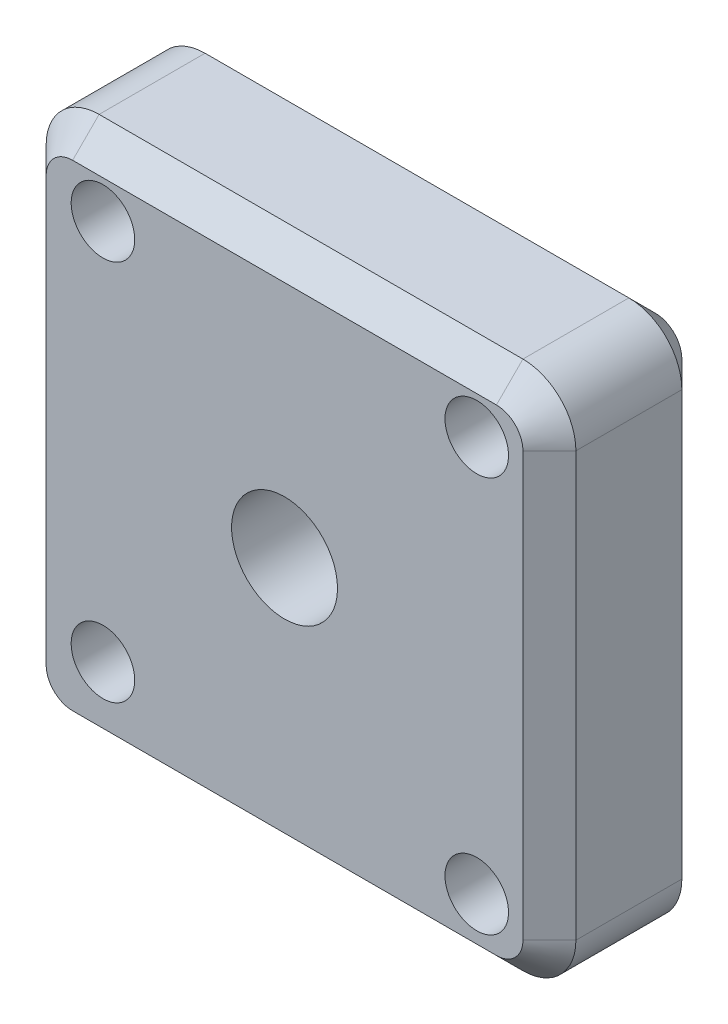
ISO-10303-21;
HEADER;
FILE_DESCRIPTION(('STEP AP214'),'2;1');
FILE_NAME('part.step','',(''),(''),'','','');
FILE_SCHEMA(('AUTOMOTIVE_DESIGN { 1 0 10303 214 1 1 1 1 }'));
ENDSEC;
DATA;
#1=APPLICATION_CONTEXT('core data for automotive mechanical design processes');
#2=APPLICATION_PROTOCOL_DEFINITION('international standard','automotive_design',2000,#1);
#3=PRODUCT_CONTEXT('',#1,'mechanical');
#4=PRODUCT('Part','Part','',(#3));
#5=PRODUCT_RELATED_PRODUCT_CATEGORY('part','',(#4));
#6=PRODUCT_DEFINITION_FORMATION('','',#4);
#7=PRODUCT_DEFINITION_CONTEXT('part definition',#1,'design');
#8=PRODUCT_DEFINITION('design','',#6,#7);
#9=PRODUCT_DEFINITION_SHAPE('','',#8);
#10=(LENGTH_UNIT() NAMED_UNIT(*) SI_UNIT(.MILLI.,.METRE.));
#11=(NAMED_UNIT(*) PLANE_ANGLE_UNIT() SI_UNIT($,.RADIAN.));
#12=(NAMED_UNIT(*) SI_UNIT($,.STERADIAN.) SOLID_ANGLE_UNIT());
#13=UNCERTAINTY_MEASURE_WITH_UNIT(LENGTH_MEASURE(1.E-05),#10,'distance_accuracy_value','');
#14=(GEOMETRIC_REPRESENTATION_CONTEXT(3) GLOBAL_UNCERTAINTY_ASSIGNED_CONTEXT((#13)) GLOBAL_UNIT_ASSIGNED_CONTEXT((#10,
#11,#12)) REPRESENTATION_CONTEXT('',''));
#15=CARTESIAN_POINT('',(0.,0.,0.));
#16=DIRECTION('',(0.,0.,1.));
#17=DIRECTION('',(1.,0.,0.));
#18=AXIS2_PLACEMENT_3D('',#15,#16,#17);
#19=CARTESIAN_POINT('',(0.,0.,30.));
#20=DIRECTION('',(0.,0.,1.));
#21=DIRECTION('',(1.,0.,0.));
#22=AXIS2_PLACEMENT_3D('',#19,#20,#21);
#23=PLANE('',#22);
#24=CARTESIAN_POINT('',(36.2836259154529,37.8873220885117,30.));
#25=DIRECTION('',(0.,0.,-1.));
#26=DIRECTION('',(-1.,0.,0.));
#27=AXIS2_PLACEMENT_3D('',#24,#25,#26);
#28=CIRCLE('',#27,6.);
#29=CARTESIAN_POINT('',(30.2836259154529,37.8873220885117,30.));
#30=VERTEX_POINT('',#29);
#31=EDGE_CURVE('E422',#30,#30,#28,.T.);
#32=ORIENTED_EDGE('',*,*,#31,.T.);
#33=EDGE_LOOP('',(#32));
#34=FACE_BOUND('',#33,.T.);
#35=CARTESIAN_POINT('',(36.2836259154529,-36.8181913064723,30.));
#36=DIRECTION('',(0.,0.,-1.));
#37=DIRECTION('',(-1.,0.,0.));
#38=AXIS2_PLACEMENT_3D('',#35,#36,#37);
#39=CIRCLE('',#38,6.);
#40=CARTESIAN_POINT('',(30.2836259154529,-36.8181913064723,30.));
#41=VERTEX_POINT('',#40);
#42=EDGE_CURVE('E327',#41,#41,#39,.T.);
#43=ORIENTED_EDGE('',*,*,#42,.T.);
#44=EDGE_LOOP('',(#43));
#45=FACE_BOUND('',#44,.T.);
#46=CARTESIAN_POINT('',(40.,-40.,30.));
#47=DIRECTION('',(0.,0.,1.));
#48=DIRECTION('',(1.,0.,0.));
#49=AXIS2_PLACEMENT_3D('',#46,#47,#48);
#50=CIRCLE('',#49,5.);
#51=CARTESIAN_POINT('',(40.,-45.,30.));
#52=VERTEX_POINT('',#51);
#53=CARTESIAN_POINT('',(45.,-40.,30.));
#54=VERTEX_POINT('',#53);
#55=EDGE_CURVE('E69',#52,#54,#50,.T.);
#56=ORIENTED_EDGE('',*,*,#55,.T.);
#57=DIRECTION('',(0.,1.,0.));
#58=VECTOR('',#57,1.);
#59=CARTESIAN_POINT('',(45.,40.,30.));
#60=LINE('',#59,#58);
#61=CARTESIAN_POINT('',(45.,40.,30.));
#62=VERTEX_POINT('',#61);
#63=EDGE_CURVE('E11',#54,#62,#60,.T.);
#64=ORIENTED_EDGE('',*,*,#63,.T.);
#65=CARTESIAN_POINT('',(40.,40.,30.));
#66=DIRECTION('',(0.,0.,1.));
#67=DIRECTION('',(1.,0.,0.));
#68=AXIS2_PLACEMENT_3D('',#65,#66,#67);
#69=CIRCLE('',#68,5.);
#70=CARTESIAN_POINT('',(40.,45.,30.));
#71=VERTEX_POINT('',#70);
#72=EDGE_CURVE('E54',#62,#71,#69,.T.);
#73=ORIENTED_EDGE('',*,*,#72,.T.);
#74=DIRECTION('',(-1.,0.,0.));
#75=VECTOR('',#74,1.);
#76=CARTESIAN_POINT('',(-40.,45.,30.));
#77=LINE('',#76,#75);
#78=CARTESIAN_POINT('',(-40.,45.,30.));
#79=VERTEX_POINT('',#78);
#80=EDGE_CURVE('E292',#71,#79,#77,.T.);
#81=ORIENTED_EDGE('',*,*,#80,.T.);
#82=CARTESIAN_POINT('',(-40.,40.,30.));
#83=DIRECTION('',(0.,0.,1.));
#84=DIRECTION('',(1.,0.,0.));
#85=AXIS2_PLACEMENT_3D('',#82,#83,#84);
#86=CIRCLE('',#85,5.);
#87=CARTESIAN_POINT('',(-45.,40.,30.));
#88=VERTEX_POINT('',#87);
#89=EDGE_CURVE('E286',#79,#88,#86,.T.);
#90=ORIENTED_EDGE('',*,*,#89,.T.);
#91=DIRECTION('',(0.,-1.,0.));
#92=VECTOR('',#91,1.);
#93=CARTESIAN_POINT('',(-45.,-40.,30.));
#94=LINE('',#93,#92);
#95=CARTESIAN_POINT('',(-45.,-40.,30.));
#96=VERTEX_POINT('',#95);
#97=EDGE_CURVE('E280',#88,#96,#94,.T.);
#98=ORIENTED_EDGE('',*,*,#97,.T.);
#99=CARTESIAN_POINT('',(-40.,-40.,30.));
#100=DIRECTION('',(0.,0.,1.));
#101=DIRECTION('',(1.,0.,0.));
#102=AXIS2_PLACEMENT_3D('',#99,#100,#101);
#103=CIRCLE('',#102,5.);
#104=CARTESIAN_POINT('',(-40.,-45.,30.));
#105=VERTEX_POINT('',#104);
#106=EDGE_CURVE('E283',#96,#105,#103,.T.);
#107=ORIENTED_EDGE('',*,*,#106,.T.);
#108=DIRECTION('',(1.,0.,0.));
#109=VECTOR('',#108,1.);
#110=CARTESIAN_POINT('',(40.,-45.,30.));
#111=LINE('',#110,#109);
#112=EDGE_CURVE('E289',#105,#52,#111,.T.);
#113=ORIENTED_EDGE('',*,*,#112,.T.);
#114=EDGE_LOOP('',(#56,#64,#73,#81,#90,#98,#107,#113));
#115=FACE_BOUND('',#114,.T.);
#116=CARTESIAN_POINT('',(0.,0.,30.));
#117=DIRECTION('',(0.,0.,1.));
#118=DIRECTION('',(1.,0.,0.));
#119=AXIS2_PLACEMENT_3D('',#116,#117,#118);
#120=CIRCLE('',#119,10.);
#121=CARTESIAN_POINT('',(10.,0.,30.));
#122=VERTEX_POINT('',#121);
#123=EDGE_CURVE('E380',#122,#122,#120,.F.);
#124=ORIENTED_EDGE('',*,*,#123,.T.);
#125=EDGE_LOOP('',(#124));
#126=FACE_BOUND('',#125,.T.);
#127=CARTESIAN_POINT('',(-34.2790056991295,-34.1453643513745,30.));
#128=DIRECTION('',(0.,0.,-1.));
#129=DIRECTION('',(-1.,0.,0.));
#130=AXIS2_PLACEMENT_3D('',#127,#128,#129);
#131=CIRCLE('',#130,6.);
#132=CARTESIAN_POINT('',(-40.2790056991295,-34.1453643513745,30.));
#133=VERTEX_POINT('',#132);
#134=EDGE_CURVE('E398',#133,#133,#131,.T.);
#135=ORIENTED_EDGE('',*,*,#134,.T.);
#136=EDGE_LOOP('',(#135));
#137=FACE_BOUND('',#136,.T.);
#138=CARTESIAN_POINT('',(-34.2790056991295,37.8873220885117,30.));
#139=DIRECTION('',(0.,0.,-1.));
#140=DIRECTION('',(-1.,0.,0.));
#141=AXIS2_PLACEMENT_3D('',#138,#139,#140);
#142=CIRCLE('',#141,6.);
#143=CARTESIAN_POINT('',(-40.2790056991295,37.8873220885117,30.));
#144=VERTEX_POINT('',#143);
#145=EDGE_CURVE('E410',#144,#144,#142,.T.);
#146=ORIENTED_EDGE('',*,*,#145,.T.);
#147=EDGE_LOOP('',(#146));
#148=FACE_BOUND('',#147,.T.);
#149=ADVANCED_FACE('F43',(#34,#45,#115,#126,#137,#148),#23,.T.);
#150=CARTESIAN_POINT('',(0.,0.,0.));
#151=DIRECTION('',(0.,0.,1.));
#152=DIRECTION('',(1.,0.,0.));
#153=AXIS2_PLACEMENT_3D('',#150,#151,#152);
#154=PLANE('',#153);
#155=CARTESIAN_POINT('',(36.2836259154529,37.8873220885117,0.));
#156=DIRECTION('',(0.,0.,-1.));
#157=DIRECTION('',(-1.,0.,0.));
#158=AXIS2_PLACEMENT_3D('',#155,#156,#157);
#159=CIRCLE('',#158,6.025);
#160=CARTESIAN_POINT('',(30.2586259154529,37.8873220885117,0.));
#161=VERTEX_POINT('',#160);
#162=EDGE_CURVE('E430',#161,#161,#159,.T.);
#163=ORIENTED_EDGE('',*,*,#162,.F.);
#164=EDGE_LOOP('',(#163));
#165=FACE_BOUND('',#164,.T.);
#166=CARTESIAN_POINT('',(-34.2790056991295,-34.1453643513745,0.));
#167=DIRECTION('',(0.,0.,-1.));
#168=DIRECTION('',(-1.,0.,0.));
#169=AXIS2_PLACEMENT_3D('',#166,#167,#168);
#170=CIRCLE('',#169,6.025);
#171=CARTESIAN_POINT('',(-40.3040056991295,-34.1453643513745,0.));
#172=VERTEX_POINT('',#171);
#173=EDGE_CURVE('E406',#172,#172,#170,.T.);
#174=ORIENTED_EDGE('',*,*,#173,.F.);
#175=EDGE_LOOP('',(#174));
#176=FACE_BOUND('',#175,.T.);
#177=CARTESIAN_POINT('',(-40.,40.,0.));
#178=DIRECTION('',(0.,0.,1.));
#179=DIRECTION('',(1.,0.,0.));
#180=AXIS2_PLACEMENT_3D('',#177,#178,#179);
#181=CIRCLE('',#180,4.99999999999998);
#182=CARTESIAN_POINT('',(-45.,40.,0.));
#183=VERTEX_POINT('',#182);
#184=CARTESIAN_POINT('',(-40.,45.,0.));
#185=VERTEX_POINT('',#184);
#186=EDGE_CURVE('E237',#183,#185,#181,.F.);
#187=ORIENTED_EDGE('',*,*,#186,.T.);
#188=DIRECTION('',(1.,0.,0.));
#189=VECTOR('',#188,1.);
#190=CARTESIAN_POINT('',(0.,45.,0.));
#191=LINE('',#190,#189);
#192=CARTESIAN_POINT('',(40.,45.,0.));
#193=VERTEX_POINT('',#192);
#194=EDGE_CURVE('E169',#185,#193,#191,.T.);
#195=ORIENTED_EDGE('',*,*,#194,.T.);
#196=CARTESIAN_POINT('',(40.,40.,0.));
#197=DIRECTION('',(0.,0.,1.));
#198=DIRECTION('',(1.,0.,0.));
#199=AXIS2_PLACEMENT_3D('',#196,#197,#198);
#200=CIRCLE('',#199,4.99999999999998);
#201=CARTESIAN_POINT('',(45.,40.,0.));
#202=VERTEX_POINT('',#201);
#203=EDGE_CURVE('E234',#193,#202,#200,.F.);
#204=ORIENTED_EDGE('',*,*,#203,.T.);
#205=DIRECTION('',(0.,-1.,0.));
#206=VECTOR('',#205,1.);
#207=CARTESIAN_POINT('',(45.,0.,0.));
#208=LINE('',#207,#206);
#209=CARTESIAN_POINT('',(45.,-40.,0.));
#210=VERTEX_POINT('',#209);
#211=EDGE_CURVE('E228',#202,#210,#208,.T.);
#212=ORIENTED_EDGE('',*,*,#211,.T.);
#213=CARTESIAN_POINT('',(40.,-40.,0.));
#214=DIRECTION('',(0.,0.,1.));
#215=DIRECTION('',(1.,0.,0.));
#216=AXIS2_PLACEMENT_3D('',#213,#214,#215);
#217=CIRCLE('',#216,4.99999999999998);
#218=CARTESIAN_POINT('',(40.,-45.,0.));
#219=VERTEX_POINT('',#218);
#220=EDGE_CURVE('E222',#210,#219,#217,.F.);
#221=ORIENTED_EDGE('',*,*,#220,.T.);
#222=DIRECTION('',(-1.,0.,0.));
#223=VECTOR('',#222,1.);
#224=CARTESIAN_POINT('',(0.,-45.,0.));
#225=LINE('',#224,#223);
#226=CARTESIAN_POINT('',(-40.,-45.,0.));
#227=VERTEX_POINT('',#226);
#228=EDGE_CURVE('E198',#219,#227,#225,.T.);
#229=ORIENTED_EDGE('',*,*,#228,.T.);
#230=CARTESIAN_POINT('',(-40.,-40.,0.));
#231=DIRECTION('',(0.,0.,1.));
#232=DIRECTION('',(1.,0.,0.));
#233=AXIS2_PLACEMENT_3D('',#230,#231,#232);
#234=CIRCLE('',#233,4.99999999999998);
#235=CARTESIAN_POINT('',(-45.,-40.,0.));
#236=VERTEX_POINT('',#235);
#237=EDGE_CURVE('E225',#227,#236,#234,.F.);
#238=ORIENTED_EDGE('',*,*,#237,.T.);
#239=DIRECTION('',(0.,1.,0.));
#240=VECTOR('',#239,1.);
#241=CARTESIAN_POINT('',(-45.,0.,0.));
#242=LINE('',#241,#240);
#243=EDGE_CURVE('E231',#236,#183,#242,.T.);
#244=ORIENTED_EDGE('',*,*,#243,.T.);
#245=EDGE_LOOP('',(#187,#195,#204,#212,#221,#229,#238,#244));
#246=FACE_BOUND('',#245,.T.);
#247=CARTESIAN_POINT('',(0.,0.,0.));
#248=DIRECTION('',(0.,0.,1.));
#249=DIRECTION('',(1.,0.,0.));
#250=AXIS2_PLACEMENT_3D('',#247,#248,#249);
#251=CIRCLE('',#250,10.);
#252=CARTESIAN_POINT('',(10.,0.,0.));
#253=VERTEX_POINT('',#252);
#254=EDGE_CURVE('E323',#253,#253,#251,.T.);
#255=ORIENTED_EDGE('',*,*,#254,.T.);
#256=EDGE_LOOP('',(#255));
#257=FACE_BOUND('',#256,.T.);
#258=CARTESIAN_POINT('',(36.2836259154529,-36.8181913064723,0.));
#259=DIRECTION('',(0.,0.,-1.));
#260=DIRECTION('',(-1.,0.,0.));
#261=AXIS2_PLACEMENT_3D('',#258,#259,#260);
#262=CIRCLE('',#261,6.025);
#263=CARTESIAN_POINT('',(30.2586259154529,-36.8181913064723,0.));
#264=VERTEX_POINT('',#263);
#265=EDGE_CURVE('E394',#264,#264,#262,.T.);
#266=ORIENTED_EDGE('',*,*,#265,.F.);
#267=EDGE_LOOP('',(#266));
#268=FACE_BOUND('',#267,.T.);
#269=CARTESIAN_POINT('',(-34.2790056991295,37.8873220885117,0.));
#270=DIRECTION('',(0.,0.,-1.));
#271=DIRECTION('',(-1.,0.,0.));
#272=AXIS2_PLACEMENT_3D('',#269,#270,#271);
#273=CIRCLE('',#272,6.025);
#274=CARTESIAN_POINT('',(-40.3040056991295,37.8873220885117,0.));
#275=VERTEX_POINT('',#274);
#276=EDGE_CURVE('E418',#275,#275,#273,.T.);
#277=ORIENTED_EDGE('',*,*,#276,.F.);
#278=EDGE_LOOP('',(#277));
#279=FACE_BOUND('',#278,.T.);
#280=ADVANCED_FACE('F437',(#165,#176,#246,#257,#268,#279),#154,.F.);
#281=CARTESIAN_POINT('',(-50.,-50.,30.));
#282=DIRECTION('',(1.,0.,0.));
#283=DIRECTION('',(0.,0.,-1.));
#284=AXIS2_PLACEMENT_3D('',#281,#282,#283);
#285=PLANE('',#284);
#286=DIRECTION('',(0.,0.,-1.));
#287=VECTOR('',#286,1.);
#288=CARTESIAN_POINT('',(-50.,40.,30.));
#289=LINE('',#288,#287);
#290=CARTESIAN_POINT('',(-50.,40.,25.));
#291=VERTEX_POINT('',#290);
#292=CARTESIAN_POINT('',(-50.,40.,4.99999999999999));
#293=VERTEX_POINT('',#292);
#294=EDGE_CURVE('E365',#291,#293,#289,.T.);
#295=ORIENTED_EDGE('',*,*,#294,.T.);
#296=DIRECTION('',(0.,-1.,0.));
#297=VECTOR('',#296,1.);
#298=CARTESIAN_POINT('',(-50.,-50.,4.99999999999999));
#299=LINE('',#298,#297);
#300=CARTESIAN_POINT('',(-50.,-40.,4.99999999999999));
#301=VERTEX_POINT('',#300);
#302=EDGE_CURVE('E252',#293,#301,#299,.T.);
#303=ORIENTED_EDGE('',*,*,#302,.T.);
#304=DIRECTION('',(0.,0.,-1.));
#305=VECTOR('',#304,1.);
#306=CARTESIAN_POINT('',(-50.,-40.,30.));
#307=LINE('',#306,#305);
#308=CARTESIAN_POINT('',(-50.,-40.,25.));
#309=VERTEX_POINT('',#308);
#310=EDGE_CURVE('E211',#301,#309,#307,.F.);
#311=ORIENTED_EDGE('',*,*,#310,.T.);
#312=DIRECTION('',(0.,1.,0.));
#313=VECTOR('',#312,1.);
#314=CARTESIAN_POINT('',(-50.,40.,25.));
#315=LINE('',#314,#313);
#316=EDGE_CURVE('E249',#309,#291,#315,.T.);
#317=ORIENTED_EDGE('',*,*,#316,.T.);
#318=EDGE_LOOP('',(#295,#303,#311,#317));
#319=FACE_BOUND('',#318,.T.);
#320=ADVANCED_FACE('F364',(#319),#285,.F.);
#321=CARTESIAN_POINT('',(50.,-50.,30.));
#322=DIRECTION('',(0.,1.,0.));
#323=DIRECTION('',(-1.,0.,0.));
#324=AXIS2_PLACEMENT_3D('',#321,#322,#323);
#325=PLANE('',#324);
#326=DIRECTION('',(0.,0.,-1.));
#327=VECTOR('',#326,1.);
#328=CARTESIAN_POINT('',(-40.,-50.,30.));
#329=LINE('',#328,#327);
#330=CARTESIAN_POINT('',(-40.,-50.,25.));
#331=VERTEX_POINT('',#330);
#332=CARTESIAN_POINT('',(-40.,-50.,4.99999999999999));
#333=VERTEX_POINT('',#332);
#334=EDGE_CURVE('E369',#331,#333,#329,.T.);
#335=ORIENTED_EDGE('',*,*,#334,.T.);
#336=DIRECTION('',(1.,0.,0.));
#337=VECTOR('',#336,1.);
#338=CARTESIAN_POINT('',(50.,-50.,4.99999999999999));
#339=LINE('',#338,#337);
#340=CARTESIAN_POINT('',(40.,-50.,4.99999999999999));
#341=VERTEX_POINT('',#340);
#342=EDGE_CURVE('E277',#333,#341,#339,.T.);
#343=ORIENTED_EDGE('',*,*,#342,.T.);
#344=DIRECTION('',(0.,0.,-1.));
#345=VECTOR('',#344,1.);
#346=CARTESIAN_POINT('',(40.,-50.,30.));
#347=LINE('',#346,#345);
#348=CARTESIAN_POINT('',(40.,-50.,25.));
#349=VERTEX_POINT('',#348);
#350=EDGE_CURVE('E374',#341,#349,#347,.F.);
#351=ORIENTED_EDGE('',*,*,#350,.T.);
#352=DIRECTION('',(-1.,0.,0.));
#353=VECTOR('',#352,1.);
#354=CARTESIAN_POINT('',(-40.,-50.,25.));
#355=LINE('',#354,#353);
#356=EDGE_CURVE('E274',#349,#331,#355,.T.);
#357=ORIENTED_EDGE('',*,*,#356,.T.);
#358=EDGE_LOOP('',(#335,#343,#351,#357));
#359=FACE_BOUND('',#358,.T.);
#360=ADVANCED_FACE('F481',(#359),#325,.F.);
#361=CARTESIAN_POINT('',(50.,-50.,30.));
#362=DIRECTION('',(-1.,0.,0.));
#363=DIRECTION('',(0.,-1.,0.));
#364=AXIS2_PLACEMENT_3D('',#361,#362,#363);
#365=PLANE('',#364);
#366=DIRECTION('',(0.,0.,-1.));
#367=VECTOR('',#366,1.);
#368=CARTESIAN_POINT('',(50.,-40.,30.));
#369=LINE('',#368,#367);
#370=CARTESIAN_POINT('',(50.,-40.,25.));
#371=VERTEX_POINT('',#370);
#372=CARTESIAN_POINT('',(50.,-40.,4.99999999999999));
#373=VERTEX_POINT('',#372);
#374=EDGE_CURVE('E204',#371,#373,#369,.T.);
#375=ORIENTED_EDGE('',*,*,#374,.T.);
#376=DIRECTION('',(0.,1.,0.));
#377=VECTOR('',#376,1.);
#378=CARTESIAN_POINT('',(50.,-50.,4.99999999999999));
#379=LINE('',#378,#377);
#380=CARTESIAN_POINT('',(50.,40.,4.99999999999999));
#381=VERTEX_POINT('',#380);
#382=EDGE_CURVE('E259',#373,#381,#379,.T.);
#383=ORIENTED_EDGE('',*,*,#382,.T.);
#384=DIRECTION('',(0.,0.,-1.));
#385=VECTOR('',#384,1.);
#386=CARTESIAN_POINT('',(50.,40.,30.));
#387=LINE('',#386,#385);
#388=CARTESIAN_POINT('',(50.,40.,25.));
#389=VERTEX_POINT('',#388);
#390=EDGE_CURVE('E209',#381,#389,#387,.F.);
#391=ORIENTED_EDGE('',*,*,#390,.T.);
#392=DIRECTION('',(0.,-1.,0.));
#393=VECTOR('',#392,1.);
#394=CARTESIAN_POINT('',(50.,-40.,25.));
#395=LINE('',#394,#393);
#396=EDGE_CURVE('E255',#389,#371,#395,.T.);
#397=ORIENTED_EDGE('',*,*,#396,.T.);
#398=EDGE_LOOP('',(#375,#383,#391,#397));
#399=FACE_BOUND('',#398,.T.);
#400=ADVANCED_FACE('F478',(#399),#365,.F.);
#401=CARTESIAN_POINT('',(50.,50.,30.));
#402=DIRECTION('',(0.,-1.,0.));
#403=DIRECTION('',(1.,0.,0.));
#404=AXIS2_PLACEMENT_3D('',#401,#402,#403);
#405=PLANE('',#404);
#406=DIRECTION('',(0.,0.,-1.));
#407=VECTOR('',#406,1.);
#408=CARTESIAN_POINT('',(40.,50.,30.));
#409=LINE('',#408,#407);
#410=CARTESIAN_POINT('',(40.,50.,25.));
#411=VERTEX_POINT('',#410);
#412=CARTESIAN_POINT('',(40.,50.,4.99999999999999));
#413=VERTEX_POINT('',#412);
#414=EDGE_CURVE('E195',#411,#413,#409,.T.);
#415=ORIENTED_EDGE('',*,*,#414,.T.);
#416=DIRECTION('',(-1.,0.,0.));
#417=VECTOR('',#416,1.);
#418=CARTESIAN_POINT('',(50.,50.,4.99999999999999));
#419=LINE('',#418,#417);
#420=CARTESIAN_POINT('',(-40.,50.,4.99999999999999));
#421=VERTEX_POINT('',#420);
#422=EDGE_CURVE('E167',#413,#421,#419,.T.);
#423=ORIENTED_EDGE('',*,*,#422,.T.);
#424=DIRECTION('',(0.,0.,-1.));
#425=VECTOR('',#424,1.);
#426=CARTESIAN_POINT('',(-40.,50.,30.));
#427=LINE('',#426,#425);
#428=CARTESIAN_POINT('',(-40.,50.,25.));
#429=VERTEX_POINT('',#428);
#430=EDGE_CURVE('E192',#421,#429,#427,.F.);
#431=ORIENTED_EDGE('',*,*,#430,.T.);
#432=DIRECTION('',(1.,0.,0.));
#433=VECTOR('',#432,1.);
#434=CARTESIAN_POINT('',(40.,50.,25.));
#435=LINE('',#434,#433);
#436=EDGE_CURVE('E199',#429,#411,#435,.T.);
#437=ORIENTED_EDGE('',*,*,#436,.T.);
#438=EDGE_LOOP('',(#415,#423,#431,#437));
#439=FACE_BOUND('',#438,.T.);
#440=ADVANCED_FACE('F191',(#439),#405,.F.);
#441=CARTESIAN_POINT('',(0.,0.,49.));
#442=DIRECTION('',(0.,0.,-1.));
#443=DIRECTION('',(-1.,0.,0.));
#444=AXIS2_PLACEMENT_3D('',#441,#442,#443);
#445=CYLINDRICAL_SURFACE('',#444,10.);
#446=ORIENTED_EDGE('',*,*,#123,.F.);
#447=EDGE_LOOP('',(#446));
#448=FACE_BOUND('',#447,.T.);
#449=ORIENTED_EDGE('',*,*,#254,.F.);
#450=EDGE_LOOP('',(#449));
#451=FACE_BOUND('',#450,.T.);
#452=ADVANCED_FACE('F473',(#448,#451),#445,.F.);
#453=CARTESIAN_POINT('',(-40.,-40.,30.));
#454=DIRECTION('',(0.,0.,-1.));
#455=DIRECTION('',(-1.,0.,0.));
#456=AXIS2_PLACEMENT_3D('',#453,#454,#455);
#457=CYLINDRICAL_SURFACE('',#456,10.);
#458=ORIENTED_EDGE('',*,*,#310,.F.);
#459=CARTESIAN_POINT('',(-40.,-40.,4.99999999999999));
#460=DIRECTION('',(0.,0.,1.));
#461=DIRECTION('',(1.,0.,0.));
#462=AXIS2_PLACEMENT_3D('',#459,#460,#461);
#463=CIRCLE('',#462,10.);
#464=EDGE_CURVE('E265',#301,#333,#463,.T.);
#465=ORIENTED_EDGE('',*,*,#464,.T.);
#466=ORIENTED_EDGE('',*,*,#334,.F.);
#467=CARTESIAN_POINT('',(-40.,-40.,25.));
#468=DIRECTION('',(0.,0.,1.));
#469=DIRECTION('',(1.,0.,0.));
#470=AXIS2_PLACEMENT_3D('',#467,#468,#469);
#471=CIRCLE('',#470,10.);
#472=EDGE_CURVE('E262',#331,#309,#471,.F.);
#473=ORIENTED_EDGE('',*,*,#472,.T.);
#474=EDGE_LOOP('',(#458,#465,#466,#473));
#475=FACE_BOUND('',#474,.T.);
#476=ADVANCED_FACE('F488',(#475),#457,.T.);
#477=CARTESIAN_POINT('',(-40.,40.,30.));
#478=DIRECTION('',(0.,0.,-1.));
#479=DIRECTION('',(-1.,0.,0.));
#480=AXIS2_PLACEMENT_3D('',#477,#478,#479);
#481=CYLINDRICAL_SURFACE('',#480,10.);
#482=ORIENTED_EDGE('',*,*,#430,.F.);
#483=CARTESIAN_POINT('',(-40.,40.,4.99999999999999));
#484=DIRECTION('',(0.,0.,1.));
#485=DIRECTION('',(1.,0.,0.));
#486=AXIS2_PLACEMENT_3D('',#483,#484,#485);
#487=CIRCLE('',#486,10.);
#488=EDGE_CURVE('E176',#421,#293,#487,.T.);
#489=ORIENTED_EDGE('',*,*,#488,.T.);
#490=ORIENTED_EDGE('',*,*,#294,.F.);
#491=CARTESIAN_POINT('',(-40.,40.,25.));
#492=DIRECTION('',(0.,0.,1.));
#493=DIRECTION('',(1.,0.,0.));
#494=AXIS2_PLACEMENT_3D('',#491,#492,#493);
#495=CIRCLE('',#494,10.);
#496=EDGE_CURVE('E186',#291,#429,#495,.F.);
#497=ORIENTED_EDGE('',*,*,#496,.T.);
#498=EDGE_LOOP('',(#482,#489,#490,#497));
#499=FACE_BOUND('',#498,.T.);
#500=ADVANCED_FACE('F201',(#499),#481,.T.);
#501=CARTESIAN_POINT('',(40.,40.,30.));
#502=DIRECTION('',(0.,0.,-1.));
#503=DIRECTION('',(-1.,0.,0.));
#504=AXIS2_PLACEMENT_3D('',#501,#502,#503);
#505=CYLINDRICAL_SURFACE('',#504,10.);
#506=ORIENTED_EDGE('',*,*,#390,.F.);
#507=CARTESIAN_POINT('',(40.,40.,4.99999999999999));
#508=DIRECTION('',(0.,0.,1.));
#509=DIRECTION('',(1.,0.,0.));
#510=AXIS2_PLACEMENT_3D('',#507,#508,#509);
#511=CIRCLE('',#510,10.);
#512=EDGE_CURVE('E246',#381,#413,#511,.T.);
#513=ORIENTED_EDGE('',*,*,#512,.T.);
#514=ORIENTED_EDGE('',*,*,#414,.F.);
#515=CARTESIAN_POINT('',(40.,40.,25.));
#516=DIRECTION('',(0.,0.,1.));
#517=DIRECTION('',(1.,0.,0.));
#518=AXIS2_PLACEMENT_3D('',#515,#516,#517);
#519=CIRCLE('',#518,10.);
#520=EDGE_CURVE('E185',#411,#389,#519,.F.);
#521=ORIENTED_EDGE('',*,*,#520,.T.);
#522=EDGE_LOOP('',(#506,#513,#514,#521));
#523=FACE_BOUND('',#522,.T.);
#524=ADVANCED_FACE('F494',(#523),#505,.T.);
#525=CARTESIAN_POINT('',(40.,-40.,30.));
#526=DIRECTION('',(0.,0.,-1.));
#527=DIRECTION('',(-1.,0.,0.));
#528=AXIS2_PLACEMENT_3D('',#525,#526,#527);
#529=CYLINDRICAL_SURFACE('',#528,10.);
#530=ORIENTED_EDGE('',*,*,#350,.F.);
#531=CARTESIAN_POINT('',(40.,-40.,4.99999999999999));
#532=DIRECTION('',(0.,0.,1.));
#533=DIRECTION('',(1.,0.,0.));
#534=AXIS2_PLACEMENT_3D('',#531,#532,#533);
#535=CIRCLE('',#534,10.);
#536=EDGE_CURVE('E271',#341,#373,#535,.T.);
#537=ORIENTED_EDGE('',*,*,#536,.T.);
#538=ORIENTED_EDGE('',*,*,#374,.F.);
#539=CARTESIAN_POINT('',(40.,-40.,25.));
#540=DIRECTION('',(0.,0.,1.));
#541=DIRECTION('',(1.,0.,0.));
#542=AXIS2_PLACEMENT_3D('',#539,#540,#541);
#543=CIRCLE('',#542,10.);
#544=EDGE_CURVE('E268',#371,#349,#543,.F.);
#545=ORIENTED_EDGE('',*,*,#544,.T.);
#546=EDGE_LOOP('',(#530,#537,#538,#545));
#547=FACE_BOUND('',#546,.T.);
#548=ADVANCED_FACE('F497',(#547),#529,.T.);
#549=CARTESIAN_POINT('',(50.,-50.,4.99999999999999));
#550=DIRECTION('',(0.,0.707106781186545,0.70710678118655));
#551=DIRECTION('',(1.,0.,0.));
#552=AXIS2_PLACEMENT_3D('',#549,#550,#551);
#553=PLANE('',#552);
#554=DIRECTION('',(0.,-0.70710678118655,0.707106781186545));
#555=VECTOR('',#554,1.);
#556=CARTESIAN_POINT('',(-40.,-45.,0.));
#557=LINE('',#556,#555);
#558=EDGE_CURVE('E315',#227,#333,#557,.T.);
#559=ORIENTED_EDGE('',*,*,#558,.F.);
#560=ORIENTED_EDGE('',*,*,#228,.F.);
#561=DIRECTION('',(0.,0.70710678118655,-0.707106781186545));
#562=VECTOR('',#561,1.);
#563=CARTESIAN_POINT('',(40.,-50.,4.99999999999999));
#564=LINE('',#563,#562);
#565=EDGE_CURVE('E319',#341,#219,#564,.T.);
#566=ORIENTED_EDGE('',*,*,#565,.F.);
#567=ORIENTED_EDGE('',*,*,#342,.F.);
#568=EDGE_LOOP('',(#559,#560,#566,#567));
#569=FACE_BOUND('',#568,.T.);
#570=ADVANCED_FACE('F501',(#569),#553,.F.);
#571=CARTESIAN_POINT('',(40.,-40.,0.));
#572=DIRECTION('',(0.,0.,1.));
#573=DIRECTION('',(1.,0.,0.));
#574=AXIS2_PLACEMENT_3D('',#571,#572,#573);
#575=CONICAL_SURFACE('',#574,4.99999999999998,0.785398163397451);
#576=ORIENTED_EDGE('',*,*,#565,.T.);
#577=ORIENTED_EDGE('',*,*,#220,.F.);
#578=DIRECTION('',(-0.707106781186549,0.,-0.707106781186545));
#579=VECTOR('',#578,1.);
#580=CARTESIAN_POINT('',(50.,-40.,4.99999999999999));
#581=LINE('',#580,#579);
#582=EDGE_CURVE('E311',#373,#210,#581,.T.);
#583=ORIENTED_EDGE('',*,*,#582,.F.);
#584=ORIENTED_EDGE('',*,*,#536,.F.);
#585=EDGE_LOOP('',(#576,#577,#583,#584));
#586=FACE_BOUND('',#585,.T.);
#587=ADVANCED_FACE('F541',(#586),#575,.T.);
#588=CARTESIAN_POINT('',(-40.,-40.,0.));
#589=DIRECTION('',(0.,0.,1.));
#590=DIRECTION('',(1.,0.,0.));
#591=AXIS2_PLACEMENT_3D('',#588,#589,#590);
#592=CONICAL_SURFACE('',#591,4.99999999999998,0.785398163397451);
#593=ORIENTED_EDGE('',*,*,#558,.T.);
#594=ORIENTED_EDGE('',*,*,#464,.F.);
#595=DIRECTION('',(-0.707106781186549,0.,0.707106781186545));
#596=VECTOR('',#595,1.);
#597=CARTESIAN_POINT('',(-45.,-40.,0.));
#598=LINE('',#597,#596);
#599=EDGE_CURVE('E307',#236,#301,#598,.T.);
#600=ORIENTED_EDGE('',*,*,#599,.F.);
#601=ORIENTED_EDGE('',*,*,#237,.F.);
#602=EDGE_LOOP('',(#593,#594,#600,#601));
#603=FACE_BOUND('',#602,.T.);
#604=ADVANCED_FACE('F534',(#603),#592,.T.);
#605=CARTESIAN_POINT('',(50.,-50.,4.99999999999999));
#606=DIRECTION('',(-0.707106781186545,0.,0.70710678118655));
#607=DIRECTION('',(0.,1.,0.));
#608=AXIS2_PLACEMENT_3D('',#605,#606,#607);
#609=PLANE('',#608);
#610=ORIENTED_EDGE('',*,*,#582,.T.);
#611=ORIENTED_EDGE('',*,*,#211,.F.);
#612=DIRECTION('',(-0.707106781186549,0.,-0.707106781186545));
#613=VECTOR('',#612,1.);
#614=CARTESIAN_POINT('',(50.,40.,4.99999999999999));
#615=LINE('',#614,#613);
#616=EDGE_CURVE('E303',#381,#202,#615,.T.);
#617=ORIENTED_EDGE('',*,*,#616,.F.);
#618=ORIENTED_EDGE('',*,*,#382,.F.);
#619=EDGE_LOOP('',(#610,#611,#617,#618));
#620=FACE_BOUND('',#619,.T.);
#621=ADVANCED_FACE('F527',(#620),#609,.F.);
#622=CARTESIAN_POINT('',(-50.,-50.,4.99999999999999));
#623=DIRECTION('',(0.707106781186545,0.,0.707106781186549));
#624=DIRECTION('',(0.,-1.,0.));
#625=AXIS2_PLACEMENT_3D('',#622,#623,#624);
#626=PLANE('',#625);
#627=ORIENTED_EDGE('',*,*,#599,.T.);
#628=ORIENTED_EDGE('',*,*,#302,.F.);
#629=DIRECTION('',(-0.707106781186549,0.,0.707106781186545));
#630=VECTOR('',#629,1.);
#631=CARTESIAN_POINT('',(-45.,40.,0.));
#632=LINE('',#631,#630);
#633=EDGE_CURVE('E179',#183,#293,#632,.T.);
#634=ORIENTED_EDGE('',*,*,#633,.F.);
#635=ORIENTED_EDGE('',*,*,#243,.F.);
#636=EDGE_LOOP('',(#627,#628,#634,#635));
#637=FACE_BOUND('',#636,.T.);
#638=ADVANCED_FACE('F520',(#637),#626,.F.);
#639=CARTESIAN_POINT('',(40.,40.,0.));
#640=DIRECTION('',(0.,0.,1.));
#641=DIRECTION('',(1.,0.,0.));
#642=AXIS2_PLACEMENT_3D('',#639,#640,#641);
#643=CONICAL_SURFACE('',#642,4.99999999999998,0.785398163397451);
#644=ORIENTED_EDGE('',*,*,#616,.T.);
#645=ORIENTED_EDGE('',*,*,#203,.F.);
#646=DIRECTION('',(0.,-0.707106781186549,-0.707106781186545));
#647=VECTOR('',#646,1.);
#648=CARTESIAN_POINT('',(40.,50.,4.99999999999999));
#649=LINE('',#648,#647);
#650=EDGE_CURVE('E173',#413,#193,#649,.T.);
#651=ORIENTED_EDGE('',*,*,#650,.F.);
#652=ORIENTED_EDGE('',*,*,#512,.F.);
#653=EDGE_LOOP('',(#644,#645,#651,#652));
#654=FACE_BOUND('',#653,.T.);
#655=ADVANCED_FACE('F514',(#654),#643,.T.);
#656=CARTESIAN_POINT('',(-40.,40.,0.));
#657=DIRECTION('',(0.,0.,1.));
#658=DIRECTION('',(1.,0.,0.));
#659=AXIS2_PLACEMENT_3D('',#656,#657,#658);
#660=CONICAL_SURFACE('',#659,4.99999999999998,0.785398163397451);
#661=ORIENTED_EDGE('',*,*,#633,.T.);
#662=ORIENTED_EDGE('',*,*,#488,.F.);
#663=DIRECTION('',(0.,0.707106781186549,0.707106781186545));
#664=VECTOR('',#663,1.);
#665=CARTESIAN_POINT('',(-40.,45.,0.));
#666=LINE('',#665,#664);
#667=EDGE_CURVE('E163',#185,#421,#666,.T.);
#668=ORIENTED_EDGE('',*,*,#667,.F.);
#669=ORIENTED_EDGE('',*,*,#186,.F.);
#670=EDGE_LOOP('',(#661,#662,#668,#669));
#671=FACE_BOUND('',#670,.T.);
#672=ADVANCED_FACE('F177',(#671),#660,.T.);
#673=CARTESIAN_POINT('',(50.,50.,4.99999999999999));
#674=DIRECTION('',(0.,-0.707106781186545,0.707106781186549));
#675=DIRECTION('',(-1.,0.,0.));
#676=AXIS2_PLACEMENT_3D('',#673,#674,#675);
#677=PLANE('',#676);
#678=ORIENTED_EDGE('',*,*,#650,.T.);
#679=ORIENTED_EDGE('',*,*,#194,.F.);
#680=ORIENTED_EDGE('',*,*,#667,.T.);
#681=ORIENTED_EDGE('',*,*,#422,.F.);
#682=EDGE_LOOP('',(#678,#679,#680,#681));
#683=FACE_BOUND('',#682,.T.);
#684=ADVANCED_FACE('F165',(#683),#677,.F.);
#685=CARTESIAN_POINT('',(-45.,0.,30.));
#686=DIRECTION('',(-0.707106781186549,0.,0.707106781186545));
#687=DIRECTION('',(0.,1.,0.));
#688=AXIS2_PLACEMENT_3D('',#685,#686,#687);
#689=PLANE('',#688);
#690=DIRECTION('',(0.707106781186545,0.,0.707106781186549));
#691=VECTOR('',#690,1.);
#692=CARTESIAN_POINT('',(-50.,40.,25.));
#693=LINE('',#692,#691);
#694=EDGE_CURVE('E345',#291,#88,#693,.T.);
#695=ORIENTED_EDGE('',*,*,#694,.F.);
#696=ORIENTED_EDGE('',*,*,#316,.F.);
#697=DIRECTION('',(-0.707106781186545,0.,-0.707106781186549));
#698=VECTOR('',#697,1.);
#699=CARTESIAN_POINT('',(-45.,-40.,30.));
#700=LINE('',#699,#698);
#701=EDGE_CURVE('E48',#96,#309,#700,.T.);
#702=ORIENTED_EDGE('',*,*,#701,.F.);
#703=ORIENTED_EDGE('',*,*,#97,.F.);
#704=EDGE_LOOP('',(#695,#696,#702,#703));
#705=FACE_BOUND('',#704,.T.);
#706=ADVANCED_FACE('F46',(#705),#689,.T.);
#707=CARTESIAN_POINT('',(-40.,-40.,30.));
#708=DIRECTION('',(0.,0.,-1.));
#709=DIRECTION('',(-1.,0.,0.));
#710=AXIS2_PLACEMENT_3D('',#707,#708,#709);
#711=CONICAL_SURFACE('',#710,5.,0.785398163397446);
#712=ORIENTED_EDGE('',*,*,#701,.T.);
#713=ORIENTED_EDGE('',*,*,#472,.F.);
#714=DIRECTION('',(0.,-0.707106781186545,-0.707106781186549));
#715=VECTOR('',#714,1.);
#716=CARTESIAN_POINT('',(-40.,-45.,30.));
#717=LINE('',#716,#715);
#718=EDGE_CURVE('E342',#105,#331,#717,.T.);
#719=ORIENTED_EDGE('',*,*,#718,.F.);
#720=ORIENTED_EDGE('',*,*,#106,.F.);
#721=EDGE_LOOP('',(#712,#713,#719,#720));
#722=FACE_BOUND('',#721,.T.);
#723=ADVANCED_FACE('F357',(#722),#711,.T.);
#724=CARTESIAN_POINT('',(-40.,40.,30.));
#725=DIRECTION('',(0.,0.,-1.));
#726=DIRECTION('',(-1.,0.,0.));
#727=AXIS2_PLACEMENT_3D('',#724,#725,#726);
#728=CONICAL_SURFACE('',#727,5.,0.785398163397446);
#729=ORIENTED_EDGE('',*,*,#694,.T.);
#730=ORIENTED_EDGE('',*,*,#89,.F.);
#731=DIRECTION('',(0.,-0.707106781186545,0.707106781186549));
#732=VECTOR('',#731,1.);
#733=CARTESIAN_POINT('',(-40.,50.,25.));
#734=LINE('',#733,#732);
#735=EDGE_CURVE('E338',#429,#79,#734,.T.);
#736=ORIENTED_EDGE('',*,*,#735,.F.);
#737=ORIENTED_EDGE('',*,*,#496,.F.);
#738=EDGE_LOOP('',(#729,#730,#736,#737));
#739=FACE_BOUND('',#738,.T.);
#740=ADVANCED_FACE('F589',(#739),#728,.T.);
#741=CARTESIAN_POINT('',(0.,-45.,30.));
#742=DIRECTION('',(0.,-0.707106781186549,0.707106781186546));
#743=DIRECTION('',(-1.,0.,0.));
#744=AXIS2_PLACEMENT_3D('',#741,#742,#743);
#745=PLANE('',#744);
#746=ORIENTED_EDGE('',*,*,#718,.T.);
#747=ORIENTED_EDGE('',*,*,#356,.F.);
#748=DIRECTION('',(0.,-0.707106781186545,-0.707106781186549));
#749=VECTOR('',#748,1.);
#750=CARTESIAN_POINT('',(40.,-45.,30.));
#751=LINE('',#750,#749);
#752=EDGE_CURVE('E334',#52,#349,#751,.T.);
#753=ORIENTED_EDGE('',*,*,#752,.F.);
#754=ORIENTED_EDGE('',*,*,#112,.F.);
#755=EDGE_LOOP('',(#746,#747,#753,#754));
#756=FACE_BOUND('',#755,.T.);
#757=ADVANCED_FACE('F582',(#756),#745,.T.);
#758=CARTESIAN_POINT('',(0.,45.,30.));
#759=DIRECTION('',(0.,0.707106781186549,0.707106781186545));
#760=DIRECTION('',(1.,0.,0.));
#761=AXIS2_PLACEMENT_3D('',#758,#759,#760);
#762=PLANE('',#761);
#763=ORIENTED_EDGE('',*,*,#735,.T.);
#764=ORIENTED_EDGE('',*,*,#80,.F.);
#765=DIRECTION('',(0.,-0.707106781186545,0.707106781186549));
#766=VECTOR('',#765,1.);
#767=CARTESIAN_POINT('',(40.,50.,25.));
#768=LINE('',#767,#766);
#769=EDGE_CURVE('E330',#411,#71,#768,.T.);
#770=ORIENTED_EDGE('',*,*,#769,.F.);
#771=ORIENTED_EDGE('',*,*,#436,.F.);
#772=EDGE_LOOP('',(#763,#764,#770,#771));
#773=FACE_BOUND('',#772,.T.);
#774=ADVANCED_FACE('F575',(#773),#762,.T.);
#775=CARTESIAN_POINT('',(40.,-40.,30.));
#776=DIRECTION('',(0.,0.,-1.));
#777=DIRECTION('',(-1.,0.,0.));
#778=AXIS2_PLACEMENT_3D('',#775,#776,#777);
#779=CONICAL_SURFACE('',#778,5.,0.785398163397446);
#780=ORIENTED_EDGE('',*,*,#752,.T.);
#781=ORIENTED_EDGE('',*,*,#544,.F.);
#782=DIRECTION('',(0.707106781186545,0.,-0.707106781186549));
#783=VECTOR('',#782,1.);
#784=CARTESIAN_POINT('',(45.,-40.,30.));
#785=LINE('',#784,#783);
#786=EDGE_CURVE('E326',#54,#371,#785,.T.);
#787=ORIENTED_EDGE('',*,*,#786,.F.);
#788=ORIENTED_EDGE('',*,*,#55,.F.);
#789=EDGE_LOOP('',(#780,#781,#787,#788));
#790=FACE_BOUND('',#789,.T.);
#791=ADVANCED_FACE('F568',(#790),#779,.T.);
#792=CARTESIAN_POINT('',(40.,40.,30.));
#793=DIRECTION('',(0.,0.,-1.));
#794=DIRECTION('',(-1.,0.,0.));
#795=AXIS2_PLACEMENT_3D('',#792,#793,#794);
#796=CONICAL_SURFACE('',#795,5.,0.785398163397446);
#797=ORIENTED_EDGE('',*,*,#769,.T.);
#798=ORIENTED_EDGE('',*,*,#72,.F.);
#799=DIRECTION('',(-0.707106781186545,0.,0.707106781186549));
#800=VECTOR('',#799,1.);
#801=CARTESIAN_POINT('',(50.,40.,25.));
#802=LINE('',#801,#800);
#803=EDGE_CURVE('E62',#389,#62,#802,.T.);
#804=ORIENTED_EDGE('',*,*,#803,.F.);
#805=ORIENTED_EDGE('',*,*,#520,.F.);
#806=EDGE_LOOP('',(#797,#798,#804,#805));
#807=FACE_BOUND('',#806,.T.);
#808=ADVANCED_FACE('F562',(#807),#796,.T.);
#809=CARTESIAN_POINT('',(45.,0.,30.));
#810=DIRECTION('',(0.707106781186549,0.,0.707106781186546));
#811=DIRECTION('',(0.,-1.,0.));
#812=AXIS2_PLACEMENT_3D('',#809,#810,#811);
#813=PLANE('',#812);
#814=ORIENTED_EDGE('',*,*,#786,.T.);
#815=ORIENTED_EDGE('',*,*,#396,.F.);
#816=ORIENTED_EDGE('',*,*,#803,.T.);
#817=ORIENTED_EDGE('',*,*,#63,.F.);
#818=EDGE_LOOP('',(#814,#815,#816,#817));
#819=FACE_BOUND('',#818,.T.);
#820=ADVANCED_FACE('F555',(#819),#813,.T.);
#821=CARTESIAN_POINT('',(36.2836259154529,-36.8181913064723,0.));
#822=DIRECTION('',(0.,0.,-1.));
#823=DIRECTION('',(-1.,0.,0.));
#824=AXIS2_PLACEMENT_3D('',#821,#822,#823);
#825=CYLINDRICAL_SURFACE('',#824,6.);
#826=ORIENTED_EDGE('',*,*,#42,.F.);
#827=EDGE_LOOP('',(#826));
#828=FACE_BOUND('',#827,.T.);
#829=CARTESIAN_POINT('',(36.2836259154529,-36.8181913064723,0.0250000000000051));
#830=DIRECTION('',(0.,0.,-1.));
#831=DIRECTION('',(-1.,0.,0.));
#832=AXIS2_PLACEMENT_3D('',#829,#830,#831);
#833=CIRCLE('',#832,6.);
#834=CARTESIAN_POINT('',(30.2836259154529,-36.8181913064723,0.0250000000000051));
#835=VERTEX_POINT('',#834);
#836=EDGE_CURVE('E390',#835,#835,#833,.T.);
#837=ORIENTED_EDGE('',*,*,#836,.T.);
#838=EDGE_LOOP('',(#837));
#839=FACE_BOUND('',#838,.T.);
#840=ADVANCED_FACE('F561',(#828,#839),#825,.F.);
#841=CARTESIAN_POINT('',(36.2836259154529,-36.8181913064723,0.));
#842=DIRECTION('',(0.,0.,-1.));
#843=DIRECTION('',(-1.,0.,0.));
#844=AXIS2_PLACEMENT_3D('',#841,#842,#843);
#845=CONICAL_SURFACE('',#844,6.025,0.785398163397448);
#846=ORIENTED_EDGE('',*,*,#836,.F.);
#847=EDGE_LOOP('',(#846));
#848=FACE_BOUND('',#847,.T.);
#849=ORIENTED_EDGE('',*,*,#265,.T.);
#850=EDGE_LOOP('',(#849));
#851=FACE_BOUND('',#850,.T.);
#852=ADVANCED_FACE('F690',(#848,#851),#845,.F.);
#853=CARTESIAN_POINT('',(-34.2790056991295,-34.1453643513745,0.));
#854=DIRECTION('',(0.,0.,-1.));
#855=DIRECTION('',(-1.,0.,0.));
#856=AXIS2_PLACEMENT_3D('',#853,#854,#855);
#857=CYLINDRICAL_SURFACE('',#856,6.);
#858=ORIENTED_EDGE('',*,*,#134,.F.);
#859=EDGE_LOOP('',(#858));
#860=FACE_BOUND('',#859,.T.);
#861=CARTESIAN_POINT('',(-34.2790056991295,-34.1453643513745,0.0250000000000051));
#862=DIRECTION('',(0.,0.,-1.));
#863=DIRECTION('',(-1.,0.,0.));
#864=AXIS2_PLACEMENT_3D('',#861,#862,#863);
#865=CIRCLE('',#864,6.);
#866=CARTESIAN_POINT('',(-40.2790056991295,-34.1453643513745,0.0250000000000051));
#867=VERTEX_POINT('',#866);
#868=EDGE_CURVE('E402',#867,#867,#865,.T.);
#869=ORIENTED_EDGE('',*,*,#868,.T.);
#870=EDGE_LOOP('',(#869));
#871=FACE_BOUND('',#870,.T.);
#872=ADVANCED_FACE('F699',(#860,#871),#857,.F.);
#873=CARTESIAN_POINT('',(-34.2790056991295,-34.1453643513745,0.));
#874=DIRECTION('',(0.,0.,-1.));
#875=DIRECTION('',(-1.,0.,0.));
#876=AXIS2_PLACEMENT_3D('',#873,#874,#875);
#877=CONICAL_SURFACE('',#876,6.025,0.785398163397448);
#878=ORIENTED_EDGE('',*,*,#868,.F.);
#879=EDGE_LOOP('',(#878));
#880=FACE_BOUND('',#879,.T.);
#881=ORIENTED_EDGE('',*,*,#173,.T.);
#882=EDGE_LOOP('',(#881));
#883=FACE_BOUND('',#882,.T.);
#884=ADVANCED_FACE('F462',(#880,#883),#877,.F.);
#885=CARTESIAN_POINT('',(-34.2790056991295,37.8873220885117,0.));
#886=DIRECTION('',(0.,0.,-1.));
#887=DIRECTION('',(-1.,0.,0.));
#888=AXIS2_PLACEMENT_3D('',#885,#886,#887);
#889=CYLINDRICAL_SURFACE('',#888,6.);
#890=ORIENTED_EDGE('',*,*,#145,.F.);
#891=EDGE_LOOP('',(#890));
#892=FACE_BOUND('',#891,.T.);
#893=CARTESIAN_POINT('',(-34.2790056991295,37.8873220885117,0.0250000000000051));
#894=DIRECTION('',(0.,0.,-1.));
#895=DIRECTION('',(-1.,0.,0.));
#896=AXIS2_PLACEMENT_3D('',#893,#894,#895);
#897=CIRCLE('',#896,6.);
#898=CARTESIAN_POINT('',(-40.2790056991295,37.8873220885117,0.0250000000000051));
#899=VERTEX_POINT('',#898);
#900=EDGE_CURVE('E414',#899,#899,#897,.T.);
#901=ORIENTED_EDGE('',*,*,#900,.T.);
#902=EDGE_LOOP('',(#901));
#903=FACE_BOUND('',#902,.T.);
#904=ADVANCED_FACE('F453',(#892,#903),#889,.F.);
#905=CARTESIAN_POINT('',(-34.2790056991295,37.8873220885117,0.));
#906=DIRECTION('',(0.,0.,-1.));
#907=DIRECTION('',(-1.,0.,0.));
#908=AXIS2_PLACEMENT_3D('',#905,#906,#907);
#909=CONICAL_SURFACE('',#908,6.025,0.785398163397448);
#910=ORIENTED_EDGE('',*,*,#900,.F.);
#911=EDGE_LOOP('',(#910));
#912=FACE_BOUND('',#911,.T.);
#913=ORIENTED_EDGE('',*,*,#276,.T.);
#914=EDGE_LOOP('',(#913));
#915=FACE_BOUND('',#914,.T.);
#916=ADVANCED_FACE('F450',(#912,#915),#909,.F.);
#917=CARTESIAN_POINT('',(36.2836259154529,37.8873220885117,0.));
#918=DIRECTION('',(0.,0.,-1.));
#919=DIRECTION('',(-1.,0.,0.));
#920=AXIS2_PLACEMENT_3D('',#917,#918,#919);
#921=CYLINDRICAL_SURFACE('',#920,6.);
#922=ORIENTED_EDGE('',*,*,#31,.F.);
#923=EDGE_LOOP('',(#922));
#924=FACE_BOUND('',#923,.T.);
#925=CARTESIAN_POINT('',(36.2836259154529,37.8873220885117,0.0250000000000051));
#926=DIRECTION('',(0.,0.,-1.));
#927=DIRECTION('',(-1.,0.,0.));
#928=AXIS2_PLACEMENT_3D('',#925,#926,#927);
#929=CIRCLE('',#928,6.);
#930=CARTESIAN_POINT('',(30.2836259154529,37.8873220885117,0.0250000000000051));
#931=VERTEX_POINT('',#930);
#932=EDGE_CURVE('E426',#931,#931,#929,.T.);
#933=ORIENTED_EDGE('',*,*,#932,.T.);
#934=EDGE_LOOP('',(#933));
#935=FACE_BOUND('',#934,.T.);
#936=ADVANCED_FACE('F452',(#924,#935),#921,.F.);
#937=CARTESIAN_POINT('',(36.2836259154529,37.8873220885117,0.));
#938=DIRECTION('',(0.,0.,-1.));
#939=DIRECTION('',(-1.,0.,0.));
#940=AXIS2_PLACEMENT_3D('',#937,#938,#939);
#941=CONICAL_SURFACE('',#940,6.025,0.785398163397448);
#942=ORIENTED_EDGE('',*,*,#932,.F.);
#943=EDGE_LOOP('',(#942));
#944=FACE_BOUND('',#943,.T.);
#945=ORIENTED_EDGE('',*,*,#162,.T.);
#946=EDGE_LOOP('',(#945));
#947=FACE_BOUND('',#946,.T.);
#948=ADVANCED_FACE('F435',(#944,#947),#941,.F.);
#949=CLOSED_SHELL('',(#149,#280,#320,#360,#400,#440,#452,#476,#500,#524,#548,#570,#587,#604,
#621,#638,#655,#672,#684,#706,#723,#740,#757,#774,#791,#808,#820,#840,#852,#872,#884,#904,#916,
#936,#948));
#950=MANIFOLD_SOLID_BREP('B2',#949);
#951=ADVANCED_BREP_SHAPE_REPRESENTATION('',(#18,#950),#14);
#952=SHAPE_DEFINITION_REPRESENTATION(#9,#951);
ENDSEC;
END-ISO-10303-21;
